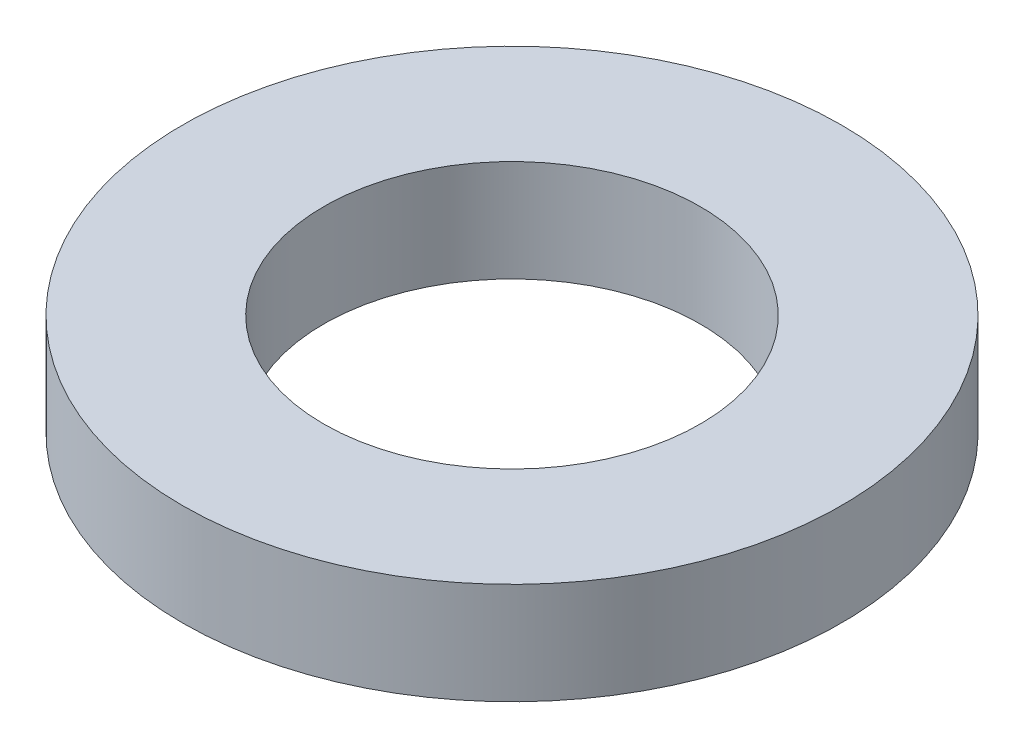
ISO-10303-21;
HEADER;
FILE_DESCRIPTION(('STEP AP214'),'2;1');
FILE_NAME('part.step','',(''),(''),'','','');
FILE_SCHEMA(('AUTOMOTIVE_DESIGN { 1 0 10303 214 1 1 1 1 }'));
ENDSEC;
DATA;
#1=APPLICATION_CONTEXT('core data for automotive mechanical design processes');
#2=APPLICATION_PROTOCOL_DEFINITION('international standard','automotive_design',2000,#1);
#3=PRODUCT_CONTEXT('',#1,'mechanical');
#4=PRODUCT('Part','Part','',(#3));
#5=PRODUCT_RELATED_PRODUCT_CATEGORY('part','',(#4));
#6=PRODUCT_DEFINITION_FORMATION('','',#4);
#7=PRODUCT_DEFINITION_CONTEXT('part definition',#1,'design');
#8=PRODUCT_DEFINITION('design','',#6,#7);
#9=PRODUCT_DEFINITION_SHAPE('','',#8);
#10=(LENGTH_UNIT() NAMED_UNIT(*) SI_UNIT(.MILLI.,.METRE.));
#11=(NAMED_UNIT(*) PLANE_ANGLE_UNIT() SI_UNIT($,.RADIAN.));
#12=(NAMED_UNIT(*) SI_UNIT($,.STERADIAN.) SOLID_ANGLE_UNIT());
#13=UNCERTAINTY_MEASURE_WITH_UNIT(LENGTH_MEASURE(1.E-05),#10,'distance_accuracy_value','');
#14=(GEOMETRIC_REPRESENTATION_CONTEXT(3) GLOBAL_UNCERTAINTY_ASSIGNED_CONTEXT((#13)) GLOBAL_UNIT_ASSIGNED_CONTEXT((#10,
#11,#12)) REPRESENTATION_CONTEXT('',''));
#15=CARTESIAN_POINT('',(0.,0.,0.));
#16=DIRECTION('',(0.,0.,1.));
#17=DIRECTION('',(1.,0.,0.));
#18=AXIS2_PLACEMENT_3D('',#15,#16,#17);
#19=CARTESIAN_POINT('',(0.,27.,0.));
#20=DIRECTION('',(0.,-1.,0.));
#21=DIRECTION('',(0.,0.,-1.));
#22=AXIS2_PLACEMENT_3D('',#19,#20,#21);
#23=CYLINDRICAL_SURFACE('',#22,87.5);
#24=CARTESIAN_POINT('',(0.,27.,0.));
#25=DIRECTION('',(0.,1.,0.));
#26=DIRECTION('',(0.,0.,1.));
#27=AXIS2_PLACEMENT_3D('',#24,#25,#26);
#28=CIRCLE('',#27,87.5);
#29=CARTESIAN_POINT('',(0.,27.,87.5));
#30=VERTEX_POINT('',#29);
#31=EDGE_CURVE('E10',#30,#30,#28,.T.);
#32=ORIENTED_EDGE('',*,*,#31,.F.);
#33=EDGE_LOOP('',(#32));
#34=FACE_BOUND('',#33,.T.);
#35=CARTESIAN_POINT('',(0.,0.,0.));
#36=DIRECTION('',(0.,1.,0.));
#37=DIRECTION('',(0.,0.,1.));
#38=AXIS2_PLACEMENT_3D('',#35,#36,#37);
#39=CIRCLE('',#38,87.5);
#40=CARTESIAN_POINT('',(0.,0.,87.5));
#41=VERTEX_POINT('',#40);
#42=EDGE_CURVE('E37',#41,#41,#39,.T.);
#43=ORIENTED_EDGE('',*,*,#42,.T.);
#44=EDGE_LOOP('',(#43));
#45=FACE_BOUND('',#44,.T.);
#46=ADVANCED_FACE('F40',(#34,#45),#23,.T.);
#47=CARTESIAN_POINT('',(0.,27.,0.));
#48=DIRECTION('',(0.,1.,0.));
#49=DIRECTION('',(0.,0.,1.));
#50=AXIS2_PLACEMENT_3D('',#47,#48,#49);
#51=PLANE('',#50);
#52=CARTESIAN_POINT('',(0.,27.,0.));
#53=DIRECTION('',(0.,1.,0.));
#54=DIRECTION('',(0.,0.,1.));
#55=AXIS2_PLACEMENT_3D('',#52,#53,#54);
#56=CIRCLE('',#55,50.);
#57=CARTESIAN_POINT('',(0.,27.,50.));
#58=VERTEX_POINT('',#57);
#59=EDGE_CURVE('E50',#58,#58,#56,.T.);
#60=ORIENTED_EDGE('',*,*,#59,.F.);
#61=EDGE_LOOP('',(#60));
#62=FACE_BOUND('',#61,.T.);
#63=ORIENTED_EDGE('',*,*,#31,.T.);
#64=EDGE_LOOP('',(#63));
#65=FACE_BOUND('',#64,.T.);
#66=ADVANCED_FACE('F59',(#62,#65),#51,.T.);
#67=CARTESIAN_POINT('',(0.,0.,0.));
#68=DIRECTION('',(0.,1.,0.));
#69=DIRECTION('',(0.,0.,1.));
#70=AXIS2_PLACEMENT_3D('',#67,#68,#69);
#71=PLANE('',#70);
#72=CARTESIAN_POINT('',(0.,0.,0.));
#73=DIRECTION('',(0.,1.,0.));
#74=DIRECTION('',(0.,0.,1.));
#75=AXIS2_PLACEMENT_3D('',#72,#73,#74);
#76=CIRCLE('',#75,50.);
#77=CARTESIAN_POINT('',(0.,0.,50.));
#78=VERTEX_POINT('',#77);
#79=EDGE_CURVE('E47',#78,#78,#76,.T.);
#80=ORIENTED_EDGE('',*,*,#79,.T.);
#81=EDGE_LOOP('',(#80));
#82=FACE_BOUND('',#81,.T.);
#83=ORIENTED_EDGE('',*,*,#42,.F.);
#84=EDGE_LOOP('',(#83));
#85=FACE_BOUND('',#84,.T.);
#86=ADVANCED_FACE('F58',(#82,#85),#71,.F.);
#87=CARTESIAN_POINT('',(0.,27.,0.));
#88=DIRECTION('',(0.,-1.,0.));
#89=DIRECTION('',(0.,0.,-1.));
#90=AXIS2_PLACEMENT_3D('',#87,#88,#89);
#91=CYLINDRICAL_SURFACE('',#90,50.);
#92=ORIENTED_EDGE('',*,*,#59,.T.);
#93=EDGE_LOOP('',(#92));
#94=FACE_BOUND('',#93,.T.);
#95=ORIENTED_EDGE('',*,*,#79,.F.);
#96=EDGE_LOOP('',(#95));
#97=FACE_BOUND('',#96,.T.);
#98=ADVANCED_FACE('F54',(#94,#97),#91,.F.);
#99=CLOSED_SHELL('',(#46,#66,#86,#98));
#100=MANIFOLD_SOLID_BREP('B2',#99);
#101=ADVANCED_BREP_SHAPE_REPRESENTATION('',(#18,#100),#14);
#102=SHAPE_DEFINITION_REPRESENTATION(#9,#101);
ENDSEC;
END-ISO-10303-21;
